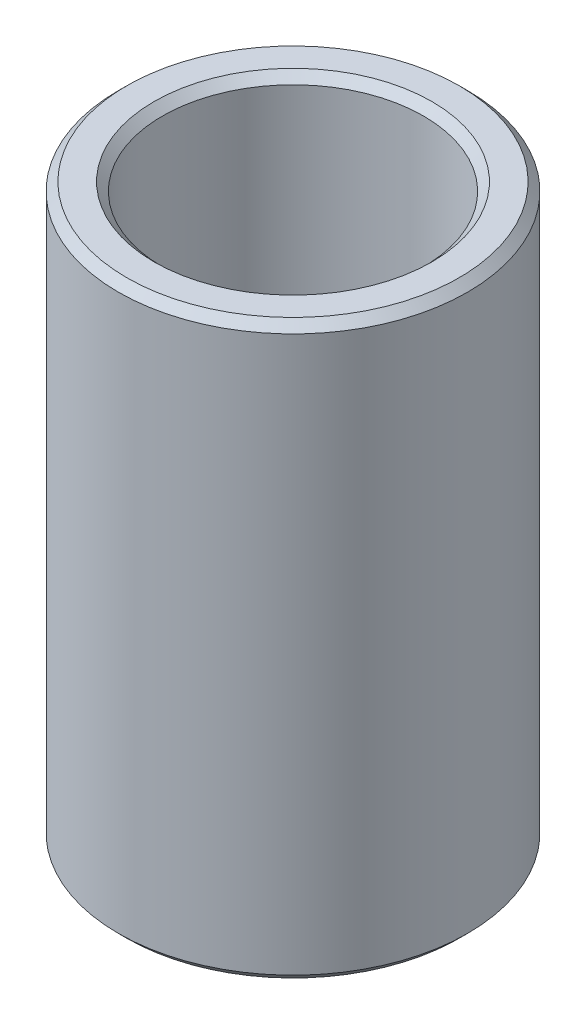
ISO-10303-21;
HEADER;
FILE_DESCRIPTION(('STEP AP214'),'2;1');
FILE_NAME('part.step','',(''),(''),'','','');
FILE_SCHEMA(('AUTOMOTIVE_DESIGN { 1 0 10303 214 1 1 1 1 }'));
ENDSEC;
DATA;
#1=APPLICATION_CONTEXT('core data for automotive mechanical design processes');
#2=APPLICATION_PROTOCOL_DEFINITION('international standard','automotive_design',2000,#1);
#3=PRODUCT_CONTEXT('',#1,'mechanical');
#4=PRODUCT('Part','Part','',(#3));
#5=PRODUCT_RELATED_PRODUCT_CATEGORY('part','',(#4));
#6=PRODUCT_DEFINITION_FORMATION('','',#4);
#7=PRODUCT_DEFINITION_CONTEXT('part definition',#1,'design');
#8=PRODUCT_DEFINITION('design','',#6,#7);
#9=PRODUCT_DEFINITION_SHAPE('','',#8);
#10=(LENGTH_UNIT() NAMED_UNIT(*) SI_UNIT(.MILLI.,.METRE.));
#11=(NAMED_UNIT(*) PLANE_ANGLE_UNIT() SI_UNIT($,.RADIAN.));
#12=(NAMED_UNIT(*) SI_UNIT($,.STERADIAN.) SOLID_ANGLE_UNIT());
#13=UNCERTAINTY_MEASURE_WITH_UNIT(LENGTH_MEASURE(1.E-05),#10,'distance_accuracy_value','');
#14=(GEOMETRIC_REPRESENTATION_CONTEXT(3) GLOBAL_UNCERTAINTY_ASSIGNED_CONTEXT((#13)) GLOBAL_UNIT_ASSIGNED_CONTEXT((#10,
#11,#12)) REPRESENTATION_CONTEXT('',''));
#15=CARTESIAN_POINT('',(0.,0.,0.));
#16=DIRECTION('',(0.,0.,1.));
#17=DIRECTION('',(1.,0.,0.));
#18=AXIS2_PLACEMENT_3D('',#15,#16,#17);
#19=CARTESIAN_POINT('',(0.,81.9049148598836,0.));
#20=DIRECTION('',(0.,-1.,0.));
#21=DIRECTION('',(0.,0.,-1.));
#22=AXIS2_PLACEMENT_3D('',#19,#20,#21);
#23=CYLINDRICAL_SURFACE('',#22,25.);
#24=CARTESIAN_POINT('',(0.,1.19629439617219,0.));
#25=DIRECTION('',(0.,1.,0.));
#26=DIRECTION('',(0.,0.,1.));
#27=AXIS2_PLACEMENT_3D('',#24,#25,#26);
#28=CIRCLE('',#27,25.);
#29=CARTESIAN_POINT('',(0.,1.19629439617219,25.));
#30=VERTEX_POINT('',#29);
#31=EDGE_CURVE('E10',#30,#30,#28,.T.);
#32=ORIENTED_EDGE('',*,*,#31,.T.);
#33=EDGE_LOOP('',(#32));
#34=FACE_BOUND('',#33,.T.);
#35=CARTESIAN_POINT('',(0.,80.7086204637114,0.));
#36=DIRECTION('',(0.,1.,0.));
#37=DIRECTION('',(0.,0.,1.));
#38=AXIS2_PLACEMENT_3D('',#35,#36,#37);
#39=CIRCLE('',#38,25.);
#40=CARTESIAN_POINT('',(0.,80.7086204637114,25.));
#41=VERTEX_POINT('',#40);
#42=EDGE_CURVE('E50',#41,#41,#39,.F.);
#43=ORIENTED_EDGE('',*,*,#42,.T.);
#44=EDGE_LOOP('',(#43));
#45=FACE_BOUND('',#44,.T.);
#46=ADVANCED_FACE('F39',(#34,#45),#23,.T.);
#47=CARTESIAN_POINT('',(0.,81.9049148598836,0.));
#48=DIRECTION('',(0.,1.,0.));
#49=DIRECTION('',(0.,0.,1.));
#50=AXIS2_PLACEMENT_3D('',#47,#48,#49);
#51=PLANE('',#50);
#52=CARTESIAN_POINT('',(0.,81.9049148598836,0.));
#53=DIRECTION('',(0.,1.,0.));
#54=DIRECTION('',(0.,0.,1.));
#55=AXIS2_PLACEMENT_3D('',#52,#53,#54);
#56=CIRCLE('',#55,19.8898216079531);
#57=CARTESIAN_POINT('',(0.,81.9049148598836,19.8898216079531));
#58=VERTEX_POINT('',#57);
#59=EDGE_CURVE('E58',#58,#58,#56,.F.);
#60=ORIENTED_EDGE('',*,*,#59,.T.);
#61=EDGE_LOOP('',(#60));
#62=FACE_BOUND('',#61,.T.);
#63=CARTESIAN_POINT('',(0.,81.9049148598836,0.));
#64=DIRECTION('',(0.,1.,0.));
#65=DIRECTION('',(0.,0.,1.));
#66=AXIS2_PLACEMENT_3D('',#63,#64,#65);
#67=CIRCLE('',#66,23.8037056038278);
#68=CARTESIAN_POINT('',(0.,81.9049148598836,23.8037056038278));
#69=VERTEX_POINT('',#68);
#70=EDGE_CURVE('E61',#69,#69,#67,.T.);
#71=ORIENTED_EDGE('',*,*,#70,.T.);
#72=EDGE_LOOP('',(#71));
#73=FACE_BOUND('',#72,.T.);
#74=ADVANCED_FACE('F88',(#62,#73),#51,.T.);
#75=CARTESIAN_POINT('',(0.,0.,0.));
#76=DIRECTION('',(0.,1.,0.));
#77=DIRECTION('',(0.,0.,1.));
#78=AXIS2_PLACEMENT_3D('',#75,#76,#77);
#79=PLANE('',#78);
#80=CARTESIAN_POINT('',(0.,0.,0.));
#81=DIRECTION('',(0.,1.,0.));
#82=DIRECTION('',(0.,0.,1.));
#83=AXIS2_PLACEMENT_3D('',#80,#81,#82);
#84=CIRCLE('',#83,19.8898216079532);
#85=CARTESIAN_POINT('',(0.,0.,19.8898216079532));
#86=VERTEX_POINT('',#85);
#87=EDGE_CURVE('E51',#86,#86,#84,.T.);
#88=ORIENTED_EDGE('',*,*,#87,.T.);
#89=EDGE_LOOP('',(#88));
#90=FACE_BOUND('',#89,.T.);
#91=CARTESIAN_POINT('',(0.,0.,0.));
#92=DIRECTION('',(0.,1.,0.));
#93=DIRECTION('',(0.,0.,1.));
#94=AXIS2_PLACEMENT_3D('',#91,#92,#93);
#95=CIRCLE('',#94,23.8037056038278);
#96=CARTESIAN_POINT('',(0.,0.,23.8037056038278));
#97=VERTEX_POINT('',#96);
#98=EDGE_CURVE('E54',#97,#97,#95,.F.);
#99=ORIENTED_EDGE('',*,*,#98,.T.);
#100=EDGE_LOOP('',(#99));
#101=FACE_BOUND('',#100,.T.);
#102=ADVANCED_FACE('F83',(#90,#101),#79,.F.);
#103=CARTESIAN_POINT('',(0.,81.9049148598836,0.));
#104=DIRECTION('',(0.,-1.,0.));
#105=DIRECTION('',(0.,0.,-1.));
#106=AXIS2_PLACEMENT_3D('',#103,#104,#105);
#107=CYLINDRICAL_SURFACE('',#106,18.693527211781);
#108=CARTESIAN_POINT('',(0.,80.7086204637114,0.));
#109=DIRECTION('',(0.,1.,0.));
#110=DIRECTION('',(0.,0.,1.));
#111=AXIS2_PLACEMENT_3D('',#108,#109,#110);
#112=CIRCLE('',#111,18.693527211781);
#113=CARTESIAN_POINT('',(0.,80.7086204637114,18.693527211781));
#114=VERTEX_POINT('',#113);
#115=EDGE_CURVE('E67',#114,#114,#112,.T.);
#116=ORIENTED_EDGE('',*,*,#115,.T.);
#117=EDGE_LOOP('',(#116));
#118=FACE_BOUND('',#117,.T.);
#119=CARTESIAN_POINT('',(0.,1.19629439617222,0.));
#120=DIRECTION('',(0.,1.,0.));
#121=DIRECTION('',(0.,0.,1.));
#122=AXIS2_PLACEMENT_3D('',#119,#120,#121);
#123=CIRCLE('',#122,18.693527211781);
#124=CARTESIAN_POINT('',(0.,1.19629439617222,18.693527211781));
#125=VERTEX_POINT('',#124);
#126=EDGE_CURVE('E69',#125,#125,#123,.F.);
#127=ORIENTED_EDGE('',*,*,#126,.T.);
#128=EDGE_LOOP('',(#127));
#129=FACE_BOUND('',#128,.T.);
#130=ADVANCED_FACE('F71',(#118,#129),#107,.F.);
#131=CARTESIAN_POINT('',(0.,80.7086204637114,0.));
#132=DIRECTION('',(0.,1.,0.));
#133=DIRECTION('',(0.,0.,1.));
#134=AXIS2_PLACEMENT_3D('',#131,#132,#133);
#135=CONICAL_SURFACE('',#134,18.693527211781,0.785398163397445);
#136=ORIENTED_EDGE('',*,*,#59,.F.);
#137=EDGE_LOOP('',(#136));
#138=FACE_BOUND('',#137,.T.);
#139=ORIENTED_EDGE('',*,*,#115,.F.);
#140=EDGE_LOOP('',(#139));
#141=FACE_BOUND('',#140,.T.);
#142=ADVANCED_FACE('F77',(#138,#141),#135,.F.);
#143=CARTESIAN_POINT('',(0.,0.,0.));
#144=DIRECTION('',(0.,-1.,0.));
#145=DIRECTION('',(0.,0.,-1.));
#146=AXIS2_PLACEMENT_3D('',#143,#144,#145);
#147=CONICAL_SURFACE('',#146,19.8898216079532,0.785398163397445);
#148=ORIENTED_EDGE('',*,*,#126,.F.);
#149=EDGE_LOOP('',(#148));
#150=FACE_BOUND('',#149,.T.);
#151=ORIENTED_EDGE('',*,*,#87,.F.);
#152=EDGE_LOOP('',(#151));
#153=FACE_BOUND('',#152,.T.);
#154=ADVANCED_FACE('F73',(#150,#153),#147,.F.);
#155=CARTESIAN_POINT('',(0.,1.19629439617219,0.));
#156=DIRECTION('',(0.,1.,0.));
#157=DIRECTION('',(0.,0.,1.));
#158=AXIS2_PLACEMENT_3D('',#155,#156,#157);
#159=CONICAL_SURFACE('',#158,25.,0.78539816339745);
#160=ORIENTED_EDGE('',*,*,#98,.F.);
#161=EDGE_LOOP('',(#160));
#162=FACE_BOUND('',#161,.T.);
#163=ORIENTED_EDGE('',*,*,#31,.F.);
#164=EDGE_LOOP('',(#163));
#165=FACE_BOUND('',#164,.T.);
#166=ADVANCED_FACE('F76',(#162,#165),#159,.T.);
#167=CARTESIAN_POINT('',(0.,81.9049148598836,0.));
#168=DIRECTION('',(0.,-1.,0.));
#169=DIRECTION('',(0.,0.,-1.));
#170=AXIS2_PLACEMENT_3D('',#167,#168,#169);
#171=CONICAL_SURFACE('',#170,23.8037056038278,0.785398163397455);
#172=ORIENTED_EDGE('',*,*,#42,.F.);
#173=EDGE_LOOP('',(#172));
#174=FACE_BOUND('',#173,.T.);
#175=ORIENTED_EDGE('',*,*,#70,.F.);
#176=EDGE_LOOP('',(#175));
#177=FACE_BOUND('',#176,.T.);
#178=ADVANCED_FACE('F45',(#174,#177),#171,.T.);
#179=CLOSED_SHELL('',(#46,#74,#102,#130,#142,#154,#166,#178));
#180=MANIFOLD_SOLID_BREP('B2',#179);
#181=ADVANCED_BREP_SHAPE_REPRESENTATION('',(#18,#180),#14);
#182=SHAPE_DEFINITION_REPRESENTATION(#9,#181);
ENDSEC;
END-ISO-10303-21;
